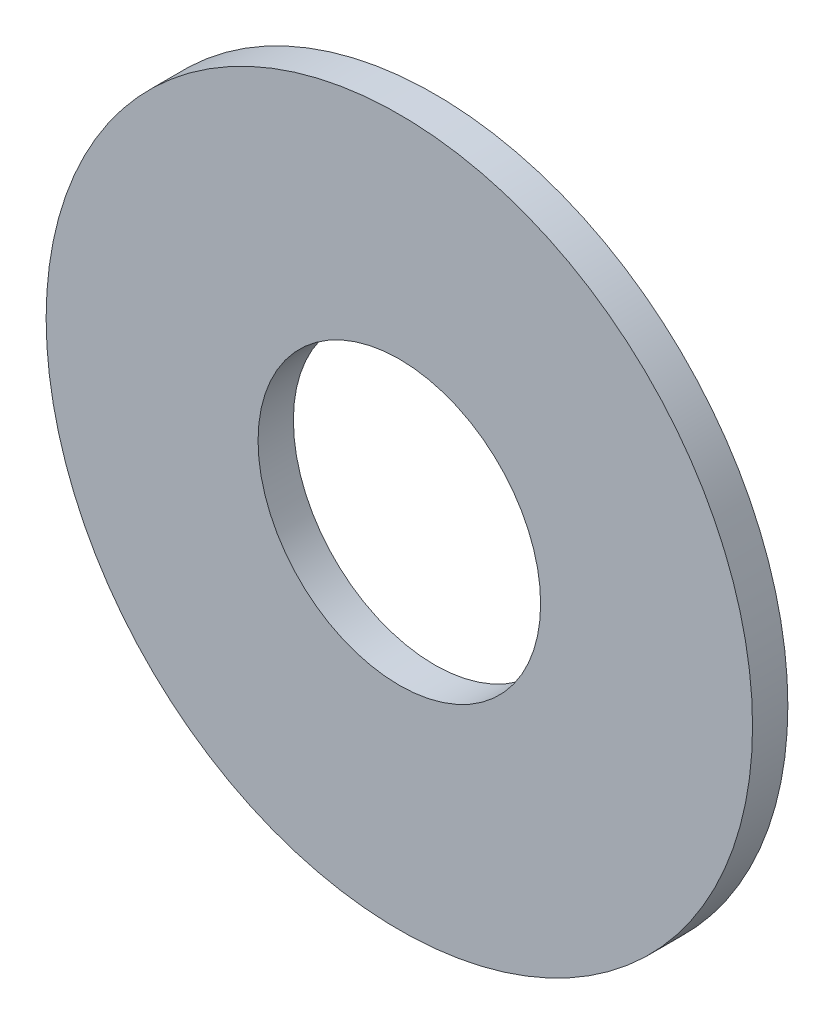
ISO-10303-21;
HEADER;
FILE_DESCRIPTION(('STEP AP214'),'2;1');
FILE_NAME('part.step','',(''),(''),'','','');
FILE_SCHEMA(('AUTOMOTIVE_DESIGN { 1 0 10303 214 1 1 1 1 }'));
ENDSEC;
DATA;
#1=APPLICATION_CONTEXT('core data for automotive mechanical design processes');
#2=APPLICATION_PROTOCOL_DEFINITION('international standard','automotive_design',2000,#1);
#3=PRODUCT_CONTEXT('',#1,'mechanical');
#4=PRODUCT('Part','Part','',(#3));
#5=PRODUCT_RELATED_PRODUCT_CATEGORY('part','',(#4));
#6=PRODUCT_DEFINITION_FORMATION('','',#4);
#7=PRODUCT_DEFINITION_CONTEXT('part definition',#1,'design');
#8=PRODUCT_DEFINITION('design','',#6,#7);
#9=PRODUCT_DEFINITION_SHAPE('','',#8);
#10=(LENGTH_UNIT() NAMED_UNIT(*) SI_UNIT(.MILLI.,.METRE.));
#11=(NAMED_UNIT(*) PLANE_ANGLE_UNIT() SI_UNIT($,.RADIAN.));
#12=(NAMED_UNIT(*) SI_UNIT($,.STERADIAN.) SOLID_ANGLE_UNIT());
#13=UNCERTAINTY_MEASURE_WITH_UNIT(LENGTH_MEASURE(1.E-05),#10,'distance_accuracy_value','');
#14=(GEOMETRIC_REPRESENTATION_CONTEXT(3) GLOBAL_UNCERTAINTY_ASSIGNED_CONTEXT((#13)) GLOBAL_UNIT_ASSIGNED_CONTEXT((#10,
#11,#12)) REPRESENTATION_CONTEXT('',''));
#15=CARTESIAN_POINT('',(0.,0.,0.));
#16=DIRECTION('',(0.,0.,1.));
#17=DIRECTION('',(1.,0.,0.));
#18=AXIS2_PLACEMENT_3D('',#15,#16,#17);
#19=CARTESIAN_POINT('',(0.,0.,1.5));
#20=DIRECTION('',(0.,0.,1.));
#21=DIRECTION('',(1.,0.,0.));
#22=AXIS2_PLACEMENT_3D('',#19,#20,#21);
#23=PLANE('',#22);
#24=CARTESIAN_POINT('',(0.,0.,1.5));
#25=DIRECTION('',(0.,0.,1.));
#26=DIRECTION('',(1.,0.,0.));
#27=AXIS2_PLACEMENT_3D('',#24,#25,#26);
#28=CIRCLE('',#27,15.);
#29=CARTESIAN_POINT('',(15.,0.,1.5));
#30=VERTEX_POINT('',#29);
#31=EDGE_CURVE('E10',#30,#30,#28,.T.);
#32=ORIENTED_EDGE('',*,*,#31,.T.);
#33=EDGE_LOOP('',(#32));
#34=FACE_BOUND('',#33,.T.);
#35=CARTESIAN_POINT('',(0.,0.,1.5));
#36=DIRECTION('',(0.,0.,1.));
#37=DIRECTION('',(1.,0.,0.));
#38=AXIS2_PLACEMENT_3D('',#35,#36,#37);
#39=CIRCLE('',#38,6.);
#40=CARTESIAN_POINT('',(6.,0.,1.5));
#41=VERTEX_POINT('',#40);
#42=EDGE_CURVE('E50',#41,#41,#39,.T.);
#43=ORIENTED_EDGE('',*,*,#42,.F.);
#44=EDGE_LOOP('',(#43));
#45=FACE_BOUND('',#44,.T.);
#46=ADVANCED_FACE('F37',(#34,#45),#23,.T.);
#47=CARTESIAN_POINT('',(0.,0.,0.));
#48=DIRECTION('',(0.,0.,1.));
#49=DIRECTION('',(1.,0.,0.));
#50=AXIS2_PLACEMENT_3D('',#47,#48,#49);
#51=PLANE('',#50);
#52=CARTESIAN_POINT('',(0.,0.,0.));
#53=DIRECTION('',(0.,0.,1.));
#54=DIRECTION('',(1.,0.,0.));
#55=AXIS2_PLACEMENT_3D('',#52,#53,#54);
#56=CIRCLE('',#55,15.);
#57=CARTESIAN_POINT('',(15.,0.,0.));
#58=VERTEX_POINT('',#57);
#59=EDGE_CURVE('E41',#58,#58,#56,.T.);
#60=ORIENTED_EDGE('',*,*,#59,.F.);
#61=EDGE_LOOP('',(#60));
#62=FACE_BOUND('',#61,.T.);
#63=CARTESIAN_POINT('',(0.,0.,0.));
#64=DIRECTION('',(0.,0.,1.));
#65=DIRECTION('',(1.,0.,0.));
#66=AXIS2_PLACEMENT_3D('',#63,#64,#65);
#67=CIRCLE('',#66,6.);
#68=CARTESIAN_POINT('',(6.,0.,0.));
#69=VERTEX_POINT('',#68);
#70=EDGE_CURVE('E52',#69,#69,#67,.T.);
#71=ORIENTED_EDGE('',*,*,#70,.T.);
#72=EDGE_LOOP('',(#71));
#73=FACE_BOUND('',#72,.T.);
#74=ADVANCED_FACE('F64',(#62,#73),#51,.F.);
#75=CARTESIAN_POINT('',(0.,0.,1.5));
#76=DIRECTION('',(0.,0.,-1.));
#77=DIRECTION('',(-1.,0.,0.));
#78=AXIS2_PLACEMENT_3D('',#75,#76,#77);
#79=CYLINDRICAL_SURFACE('',#78,15.);
#80=ORIENTED_EDGE('',*,*,#31,.F.);
#81=EDGE_LOOP('',(#80));
#82=FACE_BOUND('',#81,.T.);
#83=ORIENTED_EDGE('',*,*,#59,.T.);
#84=EDGE_LOOP('',(#83));
#85=FACE_BOUND('',#84,.T.);
#86=ADVANCED_FACE('F39',(#82,#85),#79,.T.);
#87=CARTESIAN_POINT('',(0.,0.,1.5));
#88=DIRECTION('',(0.,0.,-1.));
#89=DIRECTION('',(-1.,0.,0.));
#90=AXIS2_PLACEMENT_3D('',#87,#88,#89);
#91=CYLINDRICAL_SURFACE('',#90,6.);
#92=ORIENTED_EDGE('',*,*,#42,.T.);
#93=EDGE_LOOP('',(#92));
#94=FACE_BOUND('',#93,.T.);
#95=ORIENTED_EDGE('',*,*,#70,.F.);
#96=EDGE_LOOP('',(#95));
#97=FACE_BOUND('',#96,.T.);
#98=ADVANCED_FACE('F60',(#94,#97),#91,.F.);
#99=CLOSED_SHELL('',(#46,#74,#86,#98));
#100=MANIFOLD_SOLID_BREP('B2',#99);
#101=ADVANCED_BREP_SHAPE_REPRESENTATION('',(#18,#100),#14);
#102=SHAPE_DEFINITION_REPRESENTATION(#9,#101);
ENDSEC;
END-ISO-10303-21;
